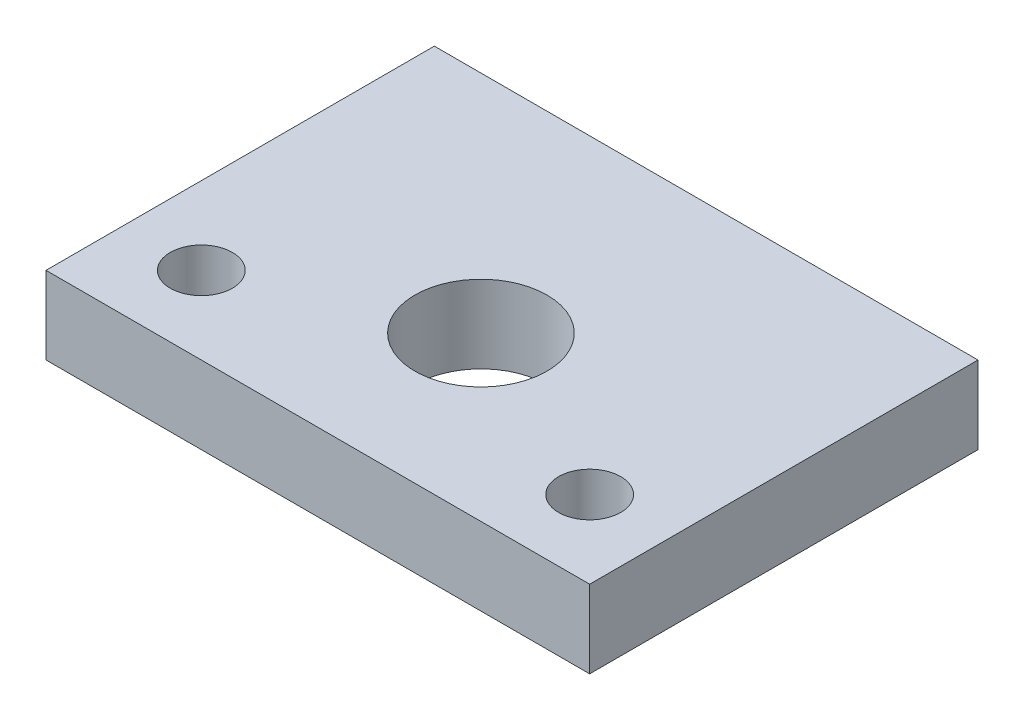
ISO-10303-21;
HEADER;
FILE_DESCRIPTION(('STEP AP214'),'2;1');
FILE_NAME('part.step','',(''),(''),'','','');
FILE_SCHEMA(('AUTOMOTIVE_DESIGN { 1 0 10303 214 1 1 1 1 }'));
ENDSEC;
DATA;
#1=APPLICATION_CONTEXT('core data for automotive mechanical design processes');
#2=APPLICATION_PROTOCOL_DEFINITION('international standard','automotive_design',2000,#1);
#3=PRODUCT_CONTEXT('',#1,'mechanical');
#4=PRODUCT('Part','Part','',(#3));
#5=PRODUCT_RELATED_PRODUCT_CATEGORY('part','',(#4));
#6=PRODUCT_DEFINITION_FORMATION('','',#4);
#7=PRODUCT_DEFINITION_CONTEXT('part definition',#1,'design');
#8=PRODUCT_DEFINITION('design','',#6,#7);
#9=PRODUCT_DEFINITION_SHAPE('','',#8);
#10=(LENGTH_UNIT() NAMED_UNIT(*) SI_UNIT(.MILLI.,.METRE.));
#11=(NAMED_UNIT(*) PLANE_ANGLE_UNIT() SI_UNIT($,.RADIAN.));
#12=(NAMED_UNIT(*) SI_UNIT($,.STERADIAN.) SOLID_ANGLE_UNIT());
#13=UNCERTAINTY_MEASURE_WITH_UNIT(LENGTH_MEASURE(1.E-05),#10,'distance_accuracy_value','');
#14=(GEOMETRIC_REPRESENTATION_CONTEXT(3) GLOBAL_UNCERTAINTY_ASSIGNED_CONTEXT((#13)) GLOBAL_UNIT_ASSIGNED_CONTEXT((#10,
#11,#12)) REPRESENTATION_CONTEXT('',''));
#15=CARTESIAN_POINT('',(0.,0.,0.));
#16=DIRECTION('',(0.,0.,1.));
#17=DIRECTION('',(1.,0.,0.));
#18=AXIS2_PLACEMENT_3D('',#15,#16,#17);
#19=CARTESIAN_POINT('',(-35.,10.,25.));
#20=DIRECTION('',(1.,0.,0.));
#21=DIRECTION('',(0.,0.,-1.));
#22=AXIS2_PLACEMENT_3D('',#19,#20,#21);
#23=PLANE('',#22);
#24=DIRECTION('',(0.,0.,1.));
#25=VECTOR('',#24,1.);
#26=CARTESIAN_POINT('',(-35.,0.,25.));
#27=LINE('',#26,#25);
#28=CARTESIAN_POINT('',(-35.,0.,-25.));
#29=VERTEX_POINT('',#28);
#30=CARTESIAN_POINT('',(-35.,0.,25.));
#31=VERTEX_POINT('',#30);
#32=EDGE_CURVE('E100',#29,#31,#27,.T.);
#33=ORIENTED_EDGE('',*,*,#32,.T.);
#34=DIRECTION('',(0.,-1.,0.));
#35=VECTOR('',#34,1.);
#36=CARTESIAN_POINT('',(-35.,10.,25.));
#37=LINE('',#36,#35);
#38=CARTESIAN_POINT('',(-35.,10.,25.));
#39=VERTEX_POINT('',#38);
#40=EDGE_CURVE('E11',#39,#31,#37,.T.);
#41=ORIENTED_EDGE('',*,*,#40,.F.);
#42=DIRECTION('',(0.,0.,1.));
#43=VECTOR('',#42,1.);
#44=CARTESIAN_POINT('',(-35.,10.,25.));
#45=LINE('',#44,#43);
#46=CARTESIAN_POINT('',(-35.,10.,-25.));
#47=VERTEX_POINT('',#46);
#48=EDGE_CURVE('E88',#47,#39,#45,.T.);
#49=ORIENTED_EDGE('',*,*,#48,.F.);
#50=DIRECTION('',(0.,-1.,0.));
#51=VECTOR('',#50,1.);
#52=CARTESIAN_POINT('',(-35.,10.,-25.));
#53=LINE('',#52,#51);
#54=EDGE_CURVE('E96',#47,#29,#53,.T.);
#55=ORIENTED_EDGE('',*,*,#54,.T.);
#56=EDGE_LOOP('',(#33,#41,#49,#55));
#57=FACE_BOUND('',#56,.T.);
#58=ADVANCED_FACE('F37',(#57),#23,.F.);
#59=CARTESIAN_POINT('',(35.,10.,25.));
#60=DIRECTION('',(0.,0.,-1.));
#61=DIRECTION('',(-1.,0.,0.));
#62=AXIS2_PLACEMENT_3D('',#59,#60,#61);
#63=PLANE('',#62);
#64=DIRECTION('',(1.,0.,0.));
#65=VECTOR('',#64,1.);
#66=CARTESIAN_POINT('',(35.,0.,25.));
#67=LINE('',#66,#65);
#68=CARTESIAN_POINT('',(35.,0.,25.));
#69=VERTEX_POINT('',#68);
#70=EDGE_CURVE('E92',#31,#69,#67,.T.);
#71=ORIENTED_EDGE('',*,*,#70,.T.);
#72=DIRECTION('',(0.,-1.,0.));
#73=VECTOR('',#72,1.);
#74=CARTESIAN_POINT('',(35.,10.,25.));
#75=LINE('',#74,#73);
#76=CARTESIAN_POINT('',(35.,10.,25.));
#77=VERTEX_POINT('',#76);
#78=EDGE_CURVE('E45',#77,#69,#75,.T.);
#79=ORIENTED_EDGE('',*,*,#78,.F.);
#80=DIRECTION('',(1.,0.,0.));
#81=VECTOR('',#80,1.);
#82=CARTESIAN_POINT('',(35.,10.,25.));
#83=LINE('',#82,#81);
#84=EDGE_CURVE('E83',#39,#77,#83,.T.);
#85=ORIENTED_EDGE('',*,*,#84,.F.);
#86=ORIENTED_EDGE('',*,*,#40,.T.);
#87=EDGE_LOOP('',(#71,#79,#85,#86));
#88=FACE_BOUND('',#87,.T.);
#89=ADVANCED_FACE('F91',(#88),#63,.F.);
#90=CARTESIAN_POINT('',(35.,10.,25.));
#91=DIRECTION('',(-1.,0.,0.));
#92=DIRECTION('',(0.,0.,1.));
#93=AXIS2_PLACEMENT_3D('',#90,#91,#92);
#94=PLANE('',#93);
#95=DIRECTION('',(0.,0.,-1.));
#96=VECTOR('',#95,1.);
#97=CARTESIAN_POINT('',(35.,0.,25.));
#98=LINE('',#97,#96);
#99=CARTESIAN_POINT('',(35.,0.,-25.));
#100=VERTEX_POINT('',#99);
#101=EDGE_CURVE('E70',#69,#100,#98,.T.);
#102=ORIENTED_EDGE('',*,*,#101,.T.);
#103=DIRECTION('',(0.,-1.,0.));
#104=VECTOR('',#103,1.);
#105=CARTESIAN_POINT('',(35.,10.,-25.));
#106=LINE('',#105,#104);
#107=CARTESIAN_POINT('',(35.,10.,-25.));
#108=VERTEX_POINT('',#107);
#109=EDGE_CURVE('E93',#108,#100,#106,.T.);
#110=ORIENTED_EDGE('',*,*,#109,.F.);
#111=DIRECTION('',(0.,0.,-1.));
#112=VECTOR('',#111,1.);
#113=CARTESIAN_POINT('',(35.,10.,25.));
#114=LINE('',#113,#112);
#115=EDGE_CURVE('E86',#77,#108,#114,.T.);
#116=ORIENTED_EDGE('',*,*,#115,.F.);
#117=ORIENTED_EDGE('',*,*,#78,.T.);
#118=EDGE_LOOP('',(#102,#110,#116,#117));
#119=FACE_BOUND('',#118,.T.);
#120=ADVANCED_FACE('F94',(#119),#94,.F.);
#121=CARTESIAN_POINT('',(35.,10.,-25.));
#122=DIRECTION('',(0.,0.,1.));
#123=DIRECTION('',(1.,0.,0.));
#124=AXIS2_PLACEMENT_3D('',#121,#122,#123);
#125=PLANE('',#124);
#126=DIRECTION('',(-1.,0.,0.));
#127=VECTOR('',#126,1.);
#128=CARTESIAN_POINT('',(35.,0.,-25.));
#129=LINE('',#128,#127);
#130=EDGE_CURVE('E76',#100,#29,#129,.T.);
#131=ORIENTED_EDGE('',*,*,#130,.T.);
#132=ORIENTED_EDGE('',*,*,#54,.F.);
#133=DIRECTION('',(-1.,0.,0.));
#134=VECTOR('',#133,1.);
#135=CARTESIAN_POINT('',(35.,10.,-25.));
#136=LINE('',#135,#134);
#137=EDGE_CURVE('E53',#108,#47,#136,.T.);
#138=ORIENTED_EDGE('',*,*,#137,.F.);
#139=ORIENTED_EDGE('',*,*,#109,.T.);
#140=EDGE_LOOP('',(#131,#132,#138,#139));
#141=FACE_BOUND('',#140,.T.);
#142=ADVANCED_FACE('F108',(#141),#125,.F.);
#143=CARTESIAN_POINT('',(0.,10.,0.));
#144=DIRECTION('',(0.,1.,0.));
#145=DIRECTION('',(0.,0.,1.));
#146=AXIS2_PLACEMENT_3D('',#143,#144,#145);
#147=PLANE('',#146);
#148=CARTESIAN_POINT('',(5.15281762734335E-13,10.,4.));
#149=DIRECTION('',(0.,-1.,0.));
#150=DIRECTION('',(0.,0.,-1.));
#151=AXIS2_PLACEMENT_3D('',#148,#149,#150);
#152=CIRCLE('',#151,8.50000000000002);
#153=CARTESIAN_POINT('',(5.15281762734335E-13,10.,-4.50000000000001));
#154=VERTEX_POINT('',#153);
#155=EDGE_CURVE('E118',#154,#154,#152,.T.);
#156=ORIENTED_EDGE('',*,*,#155,.T.);
#157=EDGE_LOOP('',(#156));
#158=FACE_BOUND('',#157,.T.);
#159=CARTESIAN_POINT('',(-25.,10.,15.));
#160=DIRECTION('',(0.,-1.,0.));
#161=DIRECTION('',(0.,0.,-1.));
#162=AXIS2_PLACEMENT_3D('',#159,#160,#161);
#163=CIRCLE('',#162,4.);
#164=CARTESIAN_POINT('',(-25.,10.,11.));
#165=VERTEX_POINT('',#164);
#166=EDGE_CURVE('E103',#165,#165,#163,.T.);
#167=ORIENTED_EDGE('',*,*,#166,.T.);
#168=EDGE_LOOP('',(#167));
#169=FACE_BOUND('',#168,.T.);
#170=CARTESIAN_POINT('',(25.,10.,15.));
#171=DIRECTION('',(0.,-1.,0.));
#172=DIRECTION('',(0.,0.,1.));
#173=AXIS2_PLACEMENT_3D('',#170,#171,#172);
#174=CIRCLE('',#173,4.);
#175=CARTESIAN_POINT('',(25.,10.,19.));
#176=VERTEX_POINT('',#175);
#177=EDGE_CURVE('E117',#176,#176,#174,.T.);
#178=ORIENTED_EDGE('',*,*,#177,.T.);
#179=EDGE_LOOP('',(#178));
#180=FACE_BOUND('',#179,.T.);
#181=ORIENTED_EDGE('',*,*,#48,.T.);
#182=ORIENTED_EDGE('',*,*,#84,.T.);
#183=ORIENTED_EDGE('',*,*,#115,.T.);
#184=ORIENTED_EDGE('',*,*,#137,.T.);
#185=EDGE_LOOP('',(#181,#182,#183,#184));
#186=FACE_BOUND('',#185,.T.);
#187=ADVANCED_FACE('F84',(#158,#169,#180,#186),#147,.T.);
#188=CARTESIAN_POINT('',(0.,0.,0.));
#189=DIRECTION('',(0.,1.,0.));
#190=DIRECTION('',(0.,0.,1.));
#191=AXIS2_PLACEMENT_3D('',#188,#189,#190);
#192=PLANE('',#191);
#193=CARTESIAN_POINT('',(5.15281762734335E-13,0.,4.));
#194=DIRECTION('',(0.,-1.,0.));
#195=DIRECTION('',(0.,0.,-1.));
#196=AXIS2_PLACEMENT_3D('',#193,#194,#195);
#197=CIRCLE('',#196,8.50000000000002);
#198=CARTESIAN_POINT('',(5.15281762734335E-13,0.,-4.50000000000001));
#199=VERTEX_POINT('',#198);
#200=EDGE_CURVE('E126',#199,#199,#197,.T.);
#201=ORIENTED_EDGE('',*,*,#200,.F.);
#202=EDGE_LOOP('',(#201));
#203=FACE_BOUND('',#202,.T.);
#204=CARTESIAN_POINT('',(-25.,0.,15.));
#205=DIRECTION('',(0.,-1.,0.));
#206=DIRECTION('',(0.,0.,-1.));
#207=AXIS2_PLACEMENT_3D('',#204,#205,#206);
#208=CIRCLE('',#207,4.);
#209=CARTESIAN_POINT('',(-25.,0.,11.));
#210=VERTEX_POINT('',#209);
#211=EDGE_CURVE('E121',#210,#210,#208,.T.);
#212=ORIENTED_EDGE('',*,*,#211,.F.);
#213=EDGE_LOOP('',(#212));
#214=FACE_BOUND('',#213,.T.);
#215=CARTESIAN_POINT('',(25.,0.,15.));
#216=DIRECTION('',(0.,-1.,0.));
#217=DIRECTION('',(0.,0.,1.));
#218=AXIS2_PLACEMENT_3D('',#215,#216,#217);
#219=CIRCLE('',#218,4.);
#220=CARTESIAN_POINT('',(25.,0.,19.));
#221=VERTEX_POINT('',#220);
#222=EDGE_CURVE('E114',#221,#221,#219,.T.);
#223=ORIENTED_EDGE('',*,*,#222,.F.);
#224=EDGE_LOOP('',(#223));
#225=FACE_BOUND('',#224,.T.);
#226=ORIENTED_EDGE('',*,*,#32,.F.);
#227=ORIENTED_EDGE('',*,*,#130,.F.);
#228=ORIENTED_EDGE('',*,*,#101,.F.);
#229=ORIENTED_EDGE('',*,*,#70,.F.);
#230=EDGE_LOOP('',(#226,#227,#228,#229));
#231=FACE_BOUND('',#230,.T.);
#232=ADVANCED_FACE('F111',(#203,#214,#225,#231),#192,.F.);
#233=CARTESIAN_POINT('',(25.,10.,15.));
#234=DIRECTION('',(0.,-1.,0.));
#235=DIRECTION('',(0.,0.,-1.));
#236=AXIS2_PLACEMENT_3D('',#233,#234,#235);
#237=CYLINDRICAL_SURFACE('',#236,4.);
#238=ORIENTED_EDGE('',*,*,#177,.F.);
#239=EDGE_LOOP('',(#238));
#240=FACE_BOUND('',#239,.T.);
#241=ORIENTED_EDGE('',*,*,#222,.T.);
#242=EDGE_LOOP('',(#241));
#243=FACE_BOUND('',#242,.T.);
#244=ADVANCED_FACE('F143',(#240,#243),#237,.F.);
#245=CARTESIAN_POINT('',(-25.,10.,15.));
#246=DIRECTION('',(0.,-1.,0.));
#247=DIRECTION('',(0.,0.,-1.));
#248=AXIS2_PLACEMENT_3D('',#245,#246,#247);
#249=CYLINDRICAL_SURFACE('',#248,4.);
#250=ORIENTED_EDGE('',*,*,#166,.F.);
#251=EDGE_LOOP('',(#250));
#252=FACE_BOUND('',#251,.T.);
#253=ORIENTED_EDGE('',*,*,#211,.T.);
#254=EDGE_LOOP('',(#253));
#255=FACE_BOUND('',#254,.T.);
#256=ADVANCED_FACE('F137',(#252,#255),#249,.F.);
#257=CARTESIAN_POINT('',(5.15281762734335E-13,10.,4.));
#258=DIRECTION('',(0.,-1.,0.));
#259=DIRECTION('',(0.,0.,-1.));
#260=AXIS2_PLACEMENT_3D('',#257,#258,#259);
#261=CYLINDRICAL_SURFACE('',#260,8.50000000000002);
#262=ORIENTED_EDGE('',*,*,#155,.F.);
#263=EDGE_LOOP('',(#262));
#264=FACE_BOUND('',#263,.T.);
#265=ORIENTED_EDGE('',*,*,#200,.T.);
#266=EDGE_LOOP('',(#265));
#267=FACE_BOUND('',#266,.T.);
#268=ADVANCED_FACE('F134',(#264,#267),#261,.F.);
#269=CLOSED_SHELL('',(#58,#89,#120,#142,#187,#232,#244,#256,#268));
#270=MANIFOLD_SOLID_BREP('B2',#269);
#271=ADVANCED_BREP_SHAPE_REPRESENTATION('',(#18,#270),#14);
#272=SHAPE_DEFINITION_REPRESENTATION(#9,#271);
ENDSEC;
END-ISO-10303-21;
